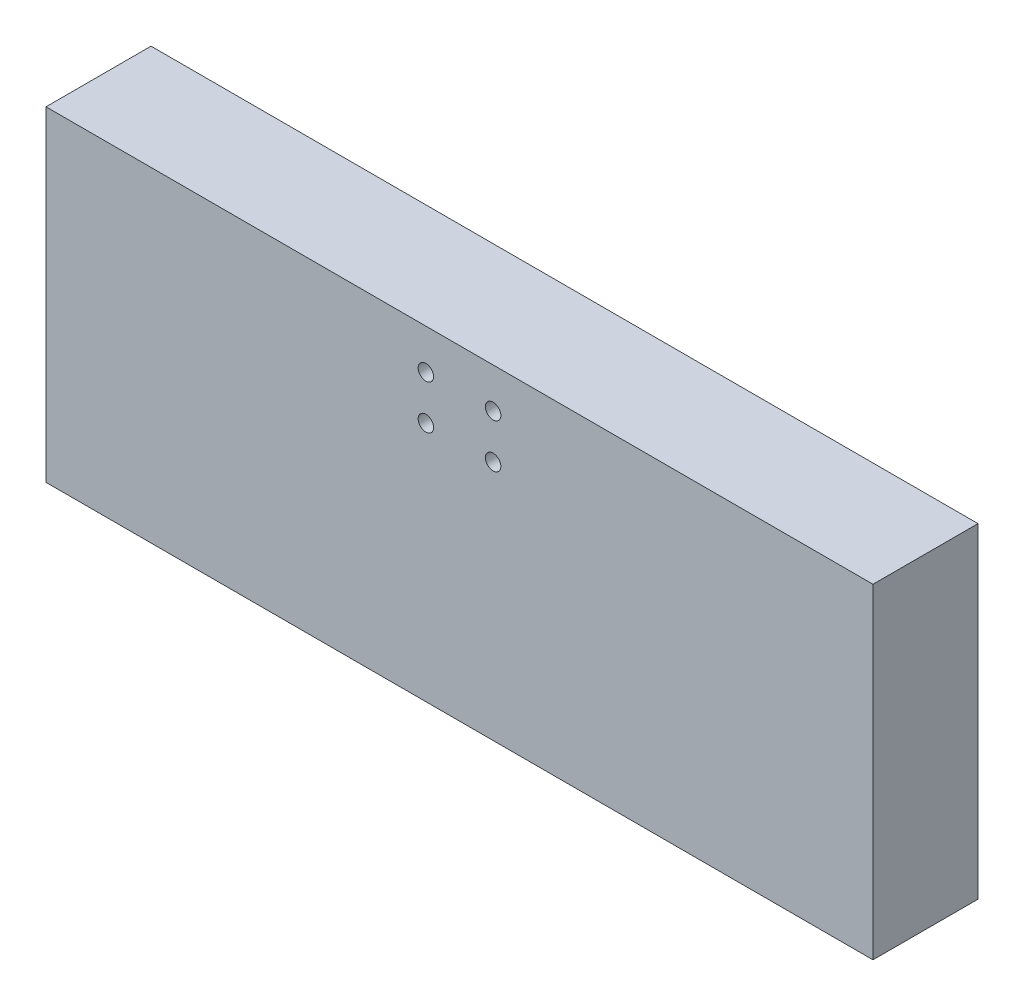
ISO-10303-21;
HEADER;
FILE_DESCRIPTION(('STEP AP214'),'2;1');
FILE_NAME('part.step','',(''),(''),'','','');
FILE_SCHEMA(('AUTOMOTIVE_DESIGN { 1 0 10303 214 1 1 1 1 }'));
ENDSEC;
DATA;
#1=APPLICATION_CONTEXT('core data for automotive mechanical design processes');
#2=APPLICATION_PROTOCOL_DEFINITION('international standard','automotive_design',2000,#1);
#3=PRODUCT_CONTEXT('',#1,'mechanical');
#4=PRODUCT('Part','Part','',(#3));
#5=PRODUCT_RELATED_PRODUCT_CATEGORY('part','',(#4));
#6=PRODUCT_DEFINITION_FORMATION('','',#4);
#7=PRODUCT_DEFINITION_CONTEXT('part definition',#1,'design');
#8=PRODUCT_DEFINITION('design','',#6,#7);
#9=PRODUCT_DEFINITION_SHAPE('','',#8);
#10=(LENGTH_UNIT() NAMED_UNIT(*) SI_UNIT(.MILLI.,.METRE.));
#11=(NAMED_UNIT(*) PLANE_ANGLE_UNIT() SI_UNIT($,.RADIAN.));
#12=(NAMED_UNIT(*) SI_UNIT($,.STERADIAN.) SOLID_ANGLE_UNIT());
#13=UNCERTAINTY_MEASURE_WITH_UNIT(LENGTH_MEASURE(1.E-05),#10,'distance_accuracy_value','');
#14=(GEOMETRIC_REPRESENTATION_CONTEXT(3) GLOBAL_UNCERTAINTY_ASSIGNED_CONTEXT((#13)) GLOBAL_UNIT_ASSIGNED_CONTEXT((#10,
#11,#12)) REPRESENTATION_CONTEXT('',''));
#15=CARTESIAN_POINT('',(0.,0.,0.));
#16=DIRECTION('',(0.,0.,1.));
#17=DIRECTION('',(1.,0.,0.));
#18=AXIS2_PLACEMENT_3D('',#15,#16,#17);
#19=CARTESIAN_POINT('',(75.,-59.,75.));
#20=DIRECTION('',(1.,0.,0.));
#21=DIRECTION('',(0.,0.,-1.));
#22=AXIS2_PLACEMENT_3D('',#19,#20,#21);
#23=PLANE('',#22);
#24=DIRECTION('',(0.,1.,0.));
#25=VECTOR('',#24,1.);
#26=CARTESIAN_POINT('',(75.,-59.,55.95));
#27=LINE('',#26,#25);
#28=CARTESIAN_POINT('',(75.,-59.,55.95));
#29=VERTEX_POINT('',#28);
#30=CARTESIAN_POINT('',(75.,0.,55.95));
#31=VERTEX_POINT('',#30);
#32=EDGE_CURVE('E90',#29,#31,#27,.T.);
#33=ORIENTED_EDGE('',*,*,#32,.T.);
#34=DIRECTION('',(0.,0.,-1.));
#35=VECTOR('',#34,1.);
#36=CARTESIAN_POINT('',(75.,0.,75.));
#37=LINE('',#36,#35);
#38=CARTESIAN_POINT('',(75.,0.,75.));
#39=VERTEX_POINT('',#38);
#40=EDGE_CURVE('E87',#39,#31,#37,.T.);
#41=ORIENTED_EDGE('',*,*,#40,.F.);
#42=DIRECTION('',(0.,1.,0.));
#43=VECTOR('',#42,1.);
#44=CARTESIAN_POINT('',(75.,-59.,75.));
#45=LINE('',#44,#43);
#46=CARTESIAN_POINT('',(75.,-59.,75.));
#47=VERTEX_POINT('',#46);
#48=EDGE_CURVE('E11',#47,#39,#45,.T.);
#49=ORIENTED_EDGE('',*,*,#48,.F.);
#50=DIRECTION('',(0.,0.,-1.));
#51=VECTOR('',#50,1.);
#52=CARTESIAN_POINT('',(75.,-59.,75.));
#53=LINE('',#52,#51);
#54=EDGE_CURVE('E99',#47,#29,#53,.T.);
#55=ORIENTED_EDGE('',*,*,#54,.T.);
#56=EDGE_LOOP('',(#33,#41,#49,#55));
#57=FACE_BOUND('',#56,.T.);
#58=ADVANCED_FACE('F43',(#57),#23,.T.);
#59=CARTESIAN_POINT('',(-75.,-59.,75.));
#60=DIRECTION('',(0.,0.,1.));
#61=DIRECTION('',(1.,0.,0.));
#62=AXIS2_PLACEMENT_3D('',#59,#60,#61);
#63=PLANE('',#62);
#64=CARTESIAN_POINT('',(6.10000000000026,-7.24999999999999,75.));
#65=DIRECTION('',(0.,0.,-1.));
#66=DIRECTION('',(-1.,0.,0.));
#67=AXIS2_PLACEMENT_3D('',#64,#65,#66);
#68=CIRCLE('',#67,1.4);
#69=CARTESIAN_POINT('',(4.70000000000026,-7.24999999999999,75.));
#70=VERTEX_POINT('',#69);
#71=EDGE_CURVE('E160',#70,#70,#68,.T.);
#72=ORIENTED_EDGE('',*,*,#71,.T.);
#73=EDGE_LOOP('',(#72));
#74=FACE_BOUND('',#73,.T.);
#75=CARTESIAN_POINT('',(-6.09999999999974,-7.25,75.));
#76=DIRECTION('',(0.,0.,1.));
#77=DIRECTION('',(1.,0.,0.));
#78=AXIS2_PLACEMENT_3D('',#75,#76,#77);
#79=CIRCLE('',#78,1.4);
#80=CARTESIAN_POINT('',(-4.69999999999974,-7.25,75.));
#81=VERTEX_POINT('',#80);
#82=EDGE_CURVE('E114',#81,#81,#79,.T.);
#83=ORIENTED_EDGE('',*,*,#82,.F.);
#84=EDGE_LOOP('',(#83));
#85=FACE_BOUND('',#84,.T.);
#86=DIRECTION('',(1.,0.,0.));
#87=VECTOR('',#86,1.);
#88=CARTESIAN_POINT('',(-75.,0.,75.));
#89=LINE('',#88,#87);
#90=CARTESIAN_POINT('',(-75.,0.,75.));
#91=VERTEX_POINT('',#90);
#92=EDGE_CURVE('E83',#91,#39,#89,.T.);
#93=ORIENTED_EDGE('',*,*,#92,.F.);
#94=DIRECTION('',(0.,1.,0.));
#95=VECTOR('',#94,1.);
#96=CARTESIAN_POINT('',(-75.,-59.,75.));
#97=LINE('',#96,#95);
#98=CARTESIAN_POINT('',(-75.,-59.,75.));
#99=VERTEX_POINT('',#98);
#100=EDGE_CURVE('E52',#99,#91,#97,.T.);
#101=ORIENTED_EDGE('',*,*,#100,.F.);
#102=DIRECTION('',(1.,0.,0.));
#103=VECTOR('',#102,1.);
#104=CARTESIAN_POINT('',(-75.,-59.,75.));
#105=LINE('',#104,#103);
#106=EDGE_CURVE('E85',#99,#47,#105,.T.);
#107=ORIENTED_EDGE('',*,*,#106,.T.);
#108=ORIENTED_EDGE('',*,*,#48,.T.);
#109=EDGE_LOOP('',(#93,#101,#107,#108));
#110=FACE_BOUND('',#109,.T.);
#111=CARTESIAN_POINT('',(6.10000000000026,-15.25,75.));
#112=DIRECTION('',(0.,0.,1.));
#113=DIRECTION('',(1.,0.,0.));
#114=AXIS2_PLACEMENT_3D('',#111,#112,#113);
#115=CIRCLE('',#114,1.4);
#116=CARTESIAN_POINT('',(7.50000000000026,-15.25,75.));
#117=VERTEX_POINT('',#116);
#118=EDGE_CURVE('E156',#117,#117,#115,.T.);
#119=ORIENTED_EDGE('',*,*,#118,.F.);
#120=EDGE_LOOP('',(#119));
#121=FACE_BOUND('',#120,.T.);
#122=CARTESIAN_POINT('',(-6.09999999999973,-15.25,75.));
#123=DIRECTION('',(0.,0.,-1.));
#124=DIRECTION('',(-1.,0.,0.));
#125=AXIS2_PLACEMENT_3D('',#122,#123,#124);
#126=CIRCLE('',#125,1.4);
#127=CARTESIAN_POINT('',(-7.49999999999973,-15.25,75.));
#128=VERTEX_POINT('',#127);
#129=EDGE_CURVE('E151',#128,#128,#126,.T.);
#130=ORIENTED_EDGE('',*,*,#129,.T.);
#131=EDGE_LOOP('',(#130));
#132=FACE_BOUND('',#131,.T.);
#133=ADVANCED_FACE('F79',(#74,#85,#110,#121,#132),#63,.T.);
#134=CARTESIAN_POINT('',(-55.95,-59.,55.95));
#135=DIRECTION('',(0.,0.,1.));
#136=DIRECTION('',(1.,0.,0.));
#137=AXIS2_PLACEMENT_3D('',#134,#135,#136);
#138=PLANE('',#137);
#139=CARTESIAN_POINT('',(6.10000000000019,-15.25,55.95));
#140=DIRECTION('',(0.,0.,1.));
#141=DIRECTION('',(1.,0.,0.));
#142=AXIS2_PLACEMENT_3D('',#139,#140,#141);
#143=CIRCLE('',#142,1.4);
#144=CARTESIAN_POINT('',(7.50000000000019,-15.25,55.95));
#145=VERTEX_POINT('',#144);
#146=EDGE_CURVE('E117',#145,#145,#143,.T.);
#147=ORIENTED_EDGE('',*,*,#146,.T.);
#148=EDGE_LOOP('',(#147));
#149=FACE_BOUND('',#148,.T.);
#150=CARTESIAN_POINT('',(-6.0999999999998,-7.25,55.95));
#151=DIRECTION('',(0.,0.,1.));
#152=DIRECTION('',(1.,0.,0.));
#153=AXIS2_PLACEMENT_3D('',#150,#151,#152);
#154=CIRCLE('',#153,1.4);
#155=CARTESIAN_POINT('',(-4.6999999999998,-7.25,55.95));
#156=VERTEX_POINT('',#155);
#157=EDGE_CURVE('E109',#156,#156,#154,.T.);
#158=ORIENTED_EDGE('',*,*,#157,.T.);
#159=EDGE_LOOP('',(#158));
#160=FACE_BOUND('',#159,.T.);
#161=DIRECTION('',(1.,0.,0.));
#162=VECTOR('',#161,1.);
#163=CARTESIAN_POINT('',(-55.95,0.,55.95));
#164=LINE('',#163,#162);
#165=CARTESIAN_POINT('',(-75.,0.,55.95));
#166=VERTEX_POINT('',#165);
#167=EDGE_CURVE('E60',#166,#31,#164,.T.);
#168=ORIENTED_EDGE('',*,*,#167,.T.);
#169=ORIENTED_EDGE('',*,*,#32,.F.);
#170=DIRECTION('',(1.,0.,0.));
#171=VECTOR('',#170,1.);
#172=CARTESIAN_POINT('',(-55.95,-59.,55.95));
#173=LINE('',#172,#171);
#174=CARTESIAN_POINT('',(-75.,-59.,55.95));
#175=VERTEX_POINT('',#174);
#176=EDGE_CURVE('E93',#175,#29,#173,.T.);
#177=ORIENTED_EDGE('',*,*,#176,.F.);
#178=DIRECTION('',(0.,1.,0.));
#179=VECTOR('',#178,1.);
#180=CARTESIAN_POINT('',(-75.,-59.,55.95));
#181=LINE('',#180,#179);
#182=EDGE_CURVE('E142',#175,#166,#181,.T.);
#183=ORIENTED_EDGE('',*,*,#182,.T.);
#184=EDGE_LOOP('',(#168,#169,#177,#183));
#185=FACE_BOUND('',#184,.T.);
#186=CARTESIAN_POINT('',(6.1000000000002,-7.24999999999999,55.95));
#187=DIRECTION('',(0.,0.,1.));
#188=DIRECTION('',(1.,0.,0.));
#189=AXIS2_PLACEMENT_3D('',#186,#187,#188);
#190=CIRCLE('',#189,1.4);
#191=CARTESIAN_POINT('',(7.5000000000002,-7.24999999999999,55.95));
#192=VERTEX_POINT('',#191);
#193=EDGE_CURVE('E113',#192,#192,#190,.F.);
#194=ORIENTED_EDGE('',*,*,#193,.F.);
#195=EDGE_LOOP('',(#194));
#196=FACE_BOUND('',#195,.T.);
#197=CARTESIAN_POINT('',(-6.0999999999998,-15.25,55.95));
#198=DIRECTION('',(0.,0.,1.));
#199=DIRECTION('',(1.,0.,0.));
#200=AXIS2_PLACEMENT_3D('',#197,#198,#199);
#201=CIRCLE('',#200,1.4);
#202=CARTESIAN_POINT('',(-4.6999999999998,-15.25,55.95));
#203=VERTEX_POINT('',#202);
#204=EDGE_CURVE('E46',#203,#203,#201,.F.);
#205=ORIENTED_EDGE('',*,*,#204,.F.);
#206=EDGE_LOOP('',(#205));
#207=FACE_BOUND('',#206,.T.);
#208=ADVANCED_FACE('F148',(#149,#160,#185,#196,#207),#138,.F.);
#209=CARTESIAN_POINT('',(-75.,-59.,75.));
#210=DIRECTION('',(-1.,0.,0.));
#211=DIRECTION('',(0.,0.,1.));
#212=AXIS2_PLACEMENT_3D('',#209,#210,#211);
#213=PLANE('',#212);
#214=ORIENTED_EDGE('',*,*,#182,.F.);
#215=DIRECTION('',(0.,0.,1.));
#216=VECTOR('',#215,1.);
#217=CARTESIAN_POINT('',(-75.,-59.,75.));
#218=LINE('',#217,#216);
#219=EDGE_CURVE('E103',#175,#99,#218,.T.);
#220=ORIENTED_EDGE('',*,*,#219,.T.);
#221=ORIENTED_EDGE('',*,*,#100,.T.);
#222=DIRECTION('',(0.,0.,1.));
#223=VECTOR('',#222,1.);
#224=CARTESIAN_POINT('',(-75.,0.,75.));
#225=LINE('',#224,#223);
#226=EDGE_CURVE('E92',#166,#91,#225,.T.);
#227=ORIENTED_EDGE('',*,*,#226,.F.);
#228=EDGE_LOOP('',(#214,#220,#221,#227));
#229=FACE_BOUND('',#228,.T.);
#230=ADVANCED_FACE('F140',(#229),#213,.T.);
#231=CARTESIAN_POINT('',(0.,-59.,0.));
#232=DIRECTION('',(0.,-1.,0.));
#233=DIRECTION('',(0.,0.,-1.));
#234=AXIS2_PLACEMENT_3D('',#231,#232,#233);
#235=PLANE('',#234);
#236=ORIENTED_EDGE('',*,*,#176,.T.);
#237=ORIENTED_EDGE('',*,*,#54,.F.);
#238=ORIENTED_EDGE('',*,*,#106,.F.);
#239=ORIENTED_EDGE('',*,*,#219,.F.);
#240=EDGE_LOOP('',(#236,#237,#238,#239));
#241=FACE_BOUND('',#240,.T.);
#242=ADVANCED_FACE('F144',(#241),#235,.T.);
#243=CARTESIAN_POINT('',(0.,0.,0.));
#244=DIRECTION('',(0.,-1.,0.));
#245=DIRECTION('',(0.,0.,-1.));
#246=AXIS2_PLACEMENT_3D('',#243,#244,#245);
#247=PLANE('',#246);
#248=ORIENTED_EDGE('',*,*,#40,.T.);
#249=ORIENTED_EDGE('',*,*,#167,.F.);
#250=ORIENTED_EDGE('',*,*,#226,.T.);
#251=ORIENTED_EDGE('',*,*,#92,.T.);
#252=EDGE_LOOP('',(#248,#249,#250,#251));
#253=FACE_BOUND('',#252,.T.);
#254=ADVANCED_FACE('F95',(#253),#247,.F.);
#255=CARTESIAN_POINT('',(-6.09999999999981,-7.25,55.));
#256=DIRECTION('',(0.,0.,1.));
#257=DIRECTION('',(1.,0.,0.));
#258=AXIS2_PLACEMENT_3D('',#255,#256,#257);
#259=CYLINDRICAL_SURFACE('',#258,1.4);
#260=ORIENTED_EDGE('',*,*,#82,.T.);
#261=EDGE_LOOP('',(#260));
#262=FACE_BOUND('',#261,.T.);
#263=ORIENTED_EDGE('',*,*,#157,.F.);
#264=EDGE_LOOP('',(#263));
#265=FACE_BOUND('',#264,.T.);
#266=ADVANCED_FACE('F170',(#262,#265),#259,.F.);
#267=CARTESIAN_POINT('',(6.10000000000019,-7.24999999999999,55.));
#268=DIRECTION('',(0.,0.,1.));
#269=DIRECTION('',(1.,0.,0.));
#270=AXIS2_PLACEMENT_3D('',#267,#268,#269);
#271=CYLINDRICAL_SURFACE('',#270,1.4);
#272=ORIENTED_EDGE('',*,*,#71,.F.);
#273=EDGE_LOOP('',(#272));
#274=FACE_BOUND('',#273,.T.);
#275=ORIENTED_EDGE('',*,*,#193,.T.);
#276=EDGE_LOOP('',(#275));
#277=FACE_BOUND('',#276,.T.);
#278=ADVANCED_FACE('F195',(#274,#277),#271,.F.);
#279=CARTESIAN_POINT('',(6.10000000000019,-15.25,55.));
#280=DIRECTION('',(0.,0.,1.));
#281=DIRECTION('',(1.,0.,0.));
#282=AXIS2_PLACEMENT_3D('',#279,#280,#281);
#283=CYLINDRICAL_SURFACE('',#282,1.4);
#284=ORIENTED_EDGE('',*,*,#118,.T.);
#285=EDGE_LOOP('',(#284));
#286=FACE_BOUND('',#285,.T.);
#287=ORIENTED_EDGE('',*,*,#146,.F.);
#288=EDGE_LOOP('',(#287));
#289=FACE_BOUND('',#288,.T.);
#290=ADVANCED_FACE('F196',(#286,#289),#283,.F.);
#291=CARTESIAN_POINT('',(-6.0999999999998,-15.25,55.));
#292=DIRECTION('',(0.,0.,1.));
#293=DIRECTION('',(1.,0.,0.));
#294=AXIS2_PLACEMENT_3D('',#291,#292,#293);
#295=CYLINDRICAL_SURFACE('',#294,1.4);
#296=ORIENTED_EDGE('',*,*,#129,.F.);
#297=EDGE_LOOP('',(#296));
#298=FACE_BOUND('',#297,.T.);
#299=ORIENTED_EDGE('',*,*,#204,.T.);
#300=EDGE_LOOP('',(#299));
#301=FACE_BOUND('',#300,.T.);
#302=ADVANCED_FACE('F199',(#298,#301),#295,.F.);
#303=CLOSED_SHELL('',(#58,#133,#208,#230,#242,#254,#266,#278,#290,#302));
#304=MANIFOLD_SOLID_BREP('B2',#303);
#305=ADVANCED_BREP_SHAPE_REPRESENTATION('',(#18,#304),#14);
#306=SHAPE_DEFINITION_REPRESENTATION(#9,#305);
ENDSEC;
END-ISO-10303-21;
